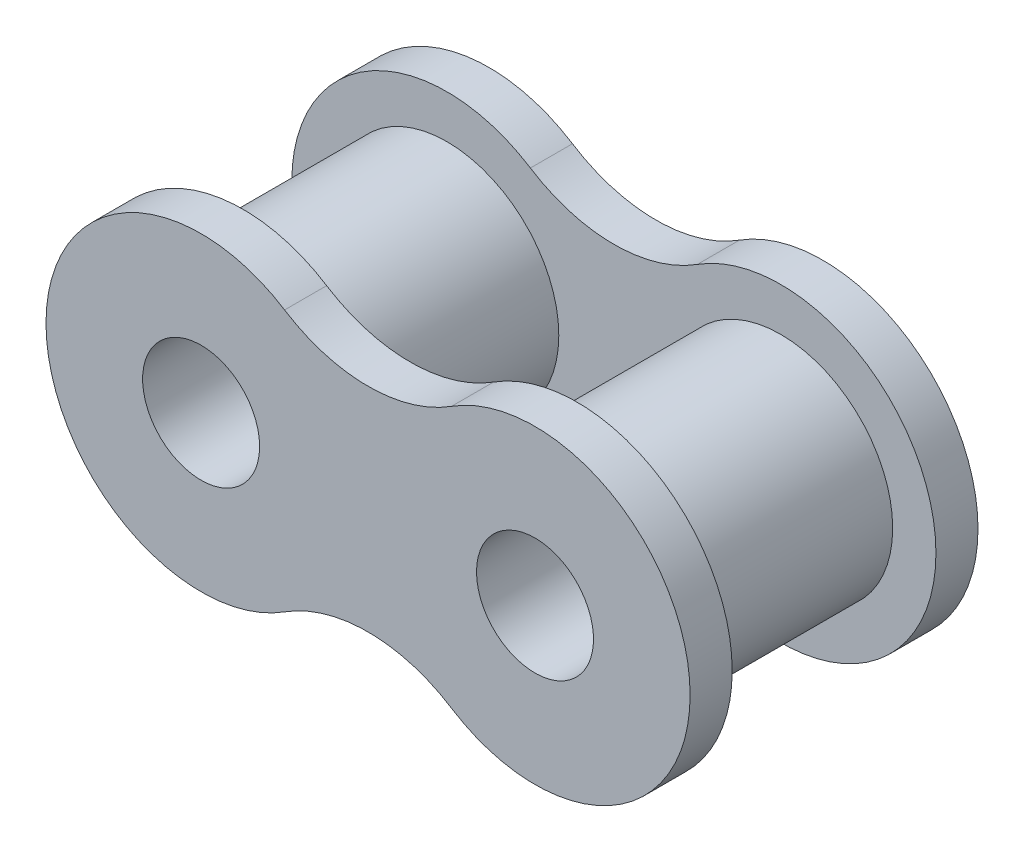
ISO-10303-21;
HEADER;
FILE_DESCRIPTION(('STEP AP214'),'2;1');
FILE_NAME('part.step','',(''),(''),'','','');
FILE_SCHEMA(('AUTOMOTIVE_DESIGN { 1 0 10303 214 1 1 1 1 }'));
ENDSEC;
DATA;
#1=APPLICATION_CONTEXT('core data for automotive mechanical design processes');
#2=APPLICATION_PROTOCOL_DEFINITION('international standard','automotive_design',2000,#1);
#3=PRODUCT_CONTEXT('',#1,'mechanical');
#4=PRODUCT('Part','Part','',(#3));
#5=PRODUCT_RELATED_PRODUCT_CATEGORY('part','',(#4));
#6=PRODUCT_DEFINITION_FORMATION('','',#4);
#7=PRODUCT_DEFINITION_CONTEXT('part definition',#1,'design');
#8=PRODUCT_DEFINITION('design','',#6,#7);
#9=PRODUCT_DEFINITION_SHAPE('','',#8);
#10=(LENGTH_UNIT() NAMED_UNIT(*) SI_UNIT(.MILLI.,.METRE.));
#11=(NAMED_UNIT(*) PLANE_ANGLE_UNIT() SI_UNIT($,.RADIAN.));
#12=(NAMED_UNIT(*) SI_UNIT($,.STERADIAN.) SOLID_ANGLE_UNIT());
#13=UNCERTAINTY_MEASURE_WITH_UNIT(LENGTH_MEASURE(1.E-05),#10,'distance_accuracy_value','');
#14=(GEOMETRIC_REPRESENTATION_CONTEXT(3) GLOBAL_UNCERTAINTY_ASSIGNED_CONTEXT((#13)) GLOBAL_UNIT_ASSIGNED_CONTEXT((#10,
#11,#12)) REPRESENTATION_CONTEXT('',''));
#15=CARTESIAN_POINT('',(0.,0.,0.));
#16=DIRECTION('',(0.,0.,1.));
#17=DIRECTION('',(1.,0.,0.));
#18=AXIS2_PLACEMENT_3D('',#15,#16,#17);
#19=CARTESIAN_POINT('',(-6.35000000000001,0.,-5.475));
#20=DIRECTION('',(0.,0.,1.));
#21=DIRECTION('',(1.,0.,0.));
#22=AXIS2_PLACEMENT_3D('',#19,#20,#21);
#23=CYLINDRICAL_SURFACE('',#22,5.90000000000001);
#24=CARTESIAN_POINT('',(-6.35000000000001,0.,-3.875));
#25=DIRECTION('',(0.,0.,1.));
#26=DIRECTION('',(1.,0.,0.));
#27=AXIS2_PLACEMENT_3D('',#24,#25,#26);
#28=CIRCLE('',#27,5.90000000000001);
#29=CARTESIAN_POINT('',(-3.175,4.97286386300692,-3.875));
#30=VERTEX_POINT('',#29);
#31=CARTESIAN_POINT('',(-3.175,-4.97286386300691,-3.875));
#32=VERTEX_POINT('',#31);
#33=EDGE_CURVE('E136',#30,#32,#28,.T.);
#34=ORIENTED_EDGE('',*,*,#33,.F.);
#35=DIRECTION('',(0.,0.,1.));
#36=VECTOR('',#35,1.);
#37=CARTESIAN_POINT('',(-3.175,4.97286386300692,-5.475));
#38=LINE('',#37,#36);
#39=CARTESIAN_POINT('',(-3.175,4.97286386300692,-5.475));
#40=VERTEX_POINT('',#39);
#41=EDGE_CURVE('E64',#40,#30,#38,.T.);
#42=ORIENTED_EDGE('',*,*,#41,.F.);
#43=CARTESIAN_POINT('',(-6.35000000000001,0.,-5.475));
#44=DIRECTION('',(0.,0.,1.));
#45=DIRECTION('',(1.,0.,0.));
#46=AXIS2_PLACEMENT_3D('',#43,#44,#45);
#47=CIRCLE('',#46,5.90000000000001);
#48=CARTESIAN_POINT('',(-3.175,-4.97286386300691,-5.475));
#49=VERTEX_POINT('',#48);
#50=EDGE_CURVE('E108',#40,#49,#47,.T.);
#51=ORIENTED_EDGE('',*,*,#50,.T.);
#52=DIRECTION('',(0.,0.,1.));
#53=VECTOR('',#52,1.);
#54=CARTESIAN_POINT('',(-3.175,-4.97286386300691,-5.475));
#55=LINE('',#54,#53);
#56=EDGE_CURVE('E79',#49,#32,#55,.T.);
#57=ORIENTED_EDGE('',*,*,#56,.T.);
#58=EDGE_LOOP('',(#34,#42,#51,#57));
#59=FACE_BOUND('',#58,.T.);
#60=ADVANCED_FACE('F56',(#59),#23,.T.);
#61=CARTESIAN_POINT('',(0.,9.94572772601383,-5.475));
#62=DIRECTION('',(0.,0.,1.));
#63=DIRECTION('',(1.,0.,0.));
#64=AXIS2_PLACEMENT_3D('',#61,#62,#63);
#65=CYLINDRICAL_SURFACE('',#64,5.9);
#66=CARTESIAN_POINT('',(0.,9.94572772601383,-3.875));
#67=DIRECTION('',(0.,0.,1.));
#68=DIRECTION('',(1.,0.,0.));
#69=AXIS2_PLACEMENT_3D('',#66,#67,#68);
#70=CIRCLE('',#69,5.9);
#71=CARTESIAN_POINT('',(3.175,4.97286386300692,-3.875));
#72=VERTEX_POINT('',#71);
#73=EDGE_CURVE('E100',#30,#72,#70,.T.);
#74=ORIENTED_EDGE('',*,*,#73,.T.);
#75=DIRECTION('',(0.,0.,1.));
#76=VECTOR('',#75,1.);
#77=CARTESIAN_POINT('',(3.175,4.97286386300692,-5.475));
#78=LINE('',#77,#76);
#79=CARTESIAN_POINT('',(3.175,4.97286386300692,-5.475));
#80=VERTEX_POINT('',#79);
#81=EDGE_CURVE('E103',#80,#72,#78,.T.);
#82=ORIENTED_EDGE('',*,*,#81,.F.);
#83=CARTESIAN_POINT('',(0.,9.94572772601383,-5.475));
#84=DIRECTION('',(0.,0.,1.));
#85=DIRECTION('',(1.,0.,0.));
#86=AXIS2_PLACEMENT_3D('',#83,#84,#85);
#87=CIRCLE('',#86,5.9);
#88=EDGE_CURVE('E87',#40,#80,#87,.T.);
#89=ORIENTED_EDGE('',*,*,#88,.F.);
#90=ORIENTED_EDGE('',*,*,#41,.T.);
#91=EDGE_LOOP('',(#74,#82,#89,#90));
#92=FACE_BOUND('',#91,.T.);
#93=ADVANCED_FACE('F102',(#92),#65,.F.);
#94=CARTESIAN_POINT('',(0.,-9.94572772601383,-5.475));
#95=DIRECTION('',(0.,0.,1.));
#96=DIRECTION('',(1.,0.,0.));
#97=AXIS2_PLACEMENT_3D('',#94,#95,#96);
#98=CYLINDRICAL_SURFACE('',#97,5.9);
#99=CARTESIAN_POINT('',(0.,-9.94572772601383,-3.875));
#100=DIRECTION('',(0.,0.,-1.));
#101=DIRECTION('',(-1.,0.,0.));
#102=AXIS2_PLACEMENT_3D('',#99,#100,#101);
#103=CIRCLE('',#102,5.9);
#104=CARTESIAN_POINT('',(3.175,-4.97286386300691,-3.875));
#105=VERTEX_POINT('',#104);
#106=EDGE_CURVE('E109',#32,#105,#103,.T.);
#107=ORIENTED_EDGE('',*,*,#106,.F.);
#108=ORIENTED_EDGE('',*,*,#56,.F.);
#109=CARTESIAN_POINT('',(0.,-9.94572772601383,-5.475));
#110=DIRECTION('',(0.,0.,-1.));
#111=DIRECTION('',(-1.,0.,0.));
#112=AXIS2_PLACEMENT_3D('',#109,#110,#111);
#113=CIRCLE('',#112,5.9);
#114=CARTESIAN_POINT('',(3.175,-4.97286386300691,-5.475));
#115=VERTEX_POINT('',#114);
#116=EDGE_CURVE('E138',#49,#115,#113,.T.);
#117=ORIENTED_EDGE('',*,*,#116,.T.);
#118=DIRECTION('',(0.,0.,1.));
#119=VECTOR('',#118,1.);
#120=CARTESIAN_POINT('',(3.175,-4.97286386300691,-5.475));
#121=LINE('',#120,#119);
#122=EDGE_CURVE('E118',#115,#105,#121,.T.);
#123=ORIENTED_EDGE('',*,*,#122,.T.);
#124=EDGE_LOOP('',(#107,#108,#117,#123));
#125=FACE_BOUND('',#124,.T.);
#126=ADVANCED_FACE('F147',(#125),#98,.F.);
#127=CARTESIAN_POINT('',(-6.35000000000001,0.,-5.475));
#128=DIRECTION('',(0.,0.,1.));
#129=DIRECTION('',(1.,0.,0.));
#130=AXIS2_PLACEMENT_3D('',#127,#128,#129);
#131=PLANE('',#130);
#132=CARTESIAN_POINT('',(-6.35000000000001,0.,-5.475));
#133=DIRECTION('',(0.,0.,1.));
#134=DIRECTION('',(1.,0.,0.));
#135=AXIS2_PLACEMENT_3D('',#132,#133,#134);
#136=CIRCLE('',#135,2.225);
#137=CARTESIAN_POINT('',(-4.12500000000001,0.,-5.475));
#138=VERTEX_POINT('',#137);
#139=EDGE_CURVE('E133',#138,#138,#136,.T.);
#140=ORIENTED_EDGE('',*,*,#139,.T.);
#141=EDGE_LOOP('',(#140));
#142=FACE_BOUND('',#141,.T.);
#143=ORIENTED_EDGE('',*,*,#50,.F.);
#144=ORIENTED_EDGE('',*,*,#88,.T.);
#145=CARTESIAN_POINT('',(6.35000000000001,0.,-5.475));
#146=DIRECTION('',(0.,0.,-1.));
#147=DIRECTION('',(-1.,0.,0.));
#148=AXIS2_PLACEMENT_3D('',#145,#146,#147);
#149=CIRCLE('',#148,5.90000000000001);
#150=EDGE_CURVE('E116',#80,#115,#149,.T.);
#151=ORIENTED_EDGE('',*,*,#150,.T.);
#152=ORIENTED_EDGE('',*,*,#116,.F.);
#153=EDGE_LOOP('',(#143,#144,#151,#152));
#154=FACE_BOUND('',#153,.T.);
#155=CARTESIAN_POINT('',(6.35000000000001,0.,-5.475));
#156=DIRECTION('',(0.,0.,-1.));
#157=DIRECTION('',(-1.,0.,0.));
#158=AXIS2_PLACEMENT_3D('',#155,#156,#157);
#159=CIRCLE('',#158,2.225);
#160=CARTESIAN_POINT('',(4.12500000000001,0.,-5.475));
#161=VERTEX_POINT('',#160);
#162=EDGE_CURVE('E123',#161,#161,#159,.T.);
#163=ORIENTED_EDGE('',*,*,#162,.F.);
#164=EDGE_LOOP('',(#163));
#165=FACE_BOUND('',#164,.T.);
#166=ADVANCED_FACE('F152',(#142,#154,#165),#131,.F.);
#167=CARTESIAN_POINT('',(-6.35000000000001,0.,-3.875));
#168=DIRECTION('',(0.,0.,1.));
#169=DIRECTION('',(1.,0.,0.));
#170=AXIS2_PLACEMENT_3D('',#167,#168,#169);
#171=PLANE('',#170);
#172=CARTESIAN_POINT('',(-6.35000000000001,0.,-3.875));
#173=DIRECTION('',(0.,0.,1.));
#174=DIRECTION('',(1.,0.,0.));
#175=AXIS2_PLACEMENT_3D('',#172,#173,#174);
#176=CIRCLE('',#175,4.255);
#177=CARTESIAN_POINT('',(-2.09500000000001,0.,-3.875));
#178=VERTEX_POINT('',#177);
#179=EDGE_CURVE('E12',#178,#178,#176,.T.);
#180=ORIENTED_EDGE('',*,*,#179,.F.);
#181=EDGE_LOOP('',(#180));
#182=FACE_BOUND('',#181,.T.);
#183=ORIENTED_EDGE('',*,*,#33,.T.);
#184=ORIENTED_EDGE('',*,*,#106,.T.);
#185=CARTESIAN_POINT('',(6.35000000000001,0.,-3.875));
#186=DIRECTION('',(0.,0.,-1.));
#187=DIRECTION('',(-1.,0.,0.));
#188=AXIS2_PLACEMENT_3D('',#185,#186,#187);
#189=CIRCLE('',#188,5.90000000000001);
#190=EDGE_CURVE('E115',#72,#105,#189,.T.);
#191=ORIENTED_EDGE('',*,*,#190,.F.);
#192=ORIENTED_EDGE('',*,*,#73,.F.);
#193=EDGE_LOOP('',(#183,#184,#191,#192));
#194=FACE_BOUND('',#193,.T.);
#195=CARTESIAN_POINT('',(6.35000000000001,0.,-3.875));
#196=DIRECTION('',(0.,0.,-1.));
#197=DIRECTION('',(-1.,0.,0.));
#198=AXIS2_PLACEMENT_3D('',#195,#196,#197);
#199=CIRCLE('',#198,4.255);
#200=CARTESIAN_POINT('',(2.09500000000001,0.,-3.875));
#201=VERTEX_POINT('',#200);
#202=EDGE_CURVE('E117',#201,#201,#199,.T.);
#203=ORIENTED_EDGE('',*,*,#202,.T.);
#204=EDGE_LOOP('',(#203));
#205=FACE_BOUND('',#204,.T.);
#206=ADVANCED_FACE('F120',(#182,#194,#205),#171,.T.);
#207=CARTESIAN_POINT('',(-6.35000000000001,0.,-5.475));
#208=DIRECTION('',(0.,0.,1.));
#209=DIRECTION('',(1.,0.,0.));
#210=AXIS2_PLACEMENT_3D('',#207,#208,#209);
#211=CYLINDRICAL_SURFACE('',#210,2.225);
#212=ORIENTED_EDGE('',*,*,#139,.F.);
#213=EDGE_LOOP('',(#212));
#214=FACE_BOUND('',#213,.T.);
#215=CARTESIAN_POINT('',(-6.35000000000001,0.,5.475));
#216=DIRECTION('',(0.,0.,1.));
#217=DIRECTION('',(1.,0.,0.));
#218=AXIS2_PLACEMENT_3D('',#215,#216,#217);
#219=CIRCLE('',#218,2.225);
#220=CARTESIAN_POINT('',(-4.12500000000001,0.,5.475));
#221=VERTEX_POINT('',#220);
#222=EDGE_CURVE('E263',#221,#221,#219,.T.);
#223=ORIENTED_EDGE('',*,*,#222,.T.);
#224=EDGE_LOOP('',(#223));
#225=FACE_BOUND('',#224,.T.);
#226=ADVANCED_FACE('F157',(#214,#225),#211,.F.);
#227=CARTESIAN_POINT('',(-6.35000000000001,0.,-15.909957415795));
#228=DIRECTION('',(0.,0.,1.));
#229=DIRECTION('',(1.,0.,0.));
#230=AXIS2_PLACEMENT_3D('',#227,#228,#229);
#231=CYLINDRICAL_SURFACE('',#230,4.255);
#232=ORIENTED_EDGE('',*,*,#179,.T.);
#233=EDGE_LOOP('',(#232));
#234=FACE_BOUND('',#233,.T.);
#235=CARTESIAN_POINT('',(-6.35000000000001,0.,3.875));
#236=DIRECTION('',(0.,0.,1.));
#237=DIRECTION('',(1.,0.,0.));
#238=AXIS2_PLACEMENT_3D('',#235,#236,#237);
#239=CIRCLE('',#238,4.255);
#240=CARTESIAN_POINT('',(-2.09500000000001,0.,3.875));
#241=VERTEX_POINT('',#240);
#242=EDGE_CURVE('E127',#241,#241,#239,.T.);
#243=ORIENTED_EDGE('',*,*,#242,.F.);
#244=EDGE_LOOP('',(#243));
#245=FACE_BOUND('',#244,.T.);
#246=ADVANCED_FACE('F164',(#234,#245),#231,.T.);
#247=CARTESIAN_POINT('',(6.35000000000001,0.,-5.475));
#248=DIRECTION('',(0.,0.,1.));
#249=DIRECTION('',(-1.,0.,0.));
#250=AXIS2_PLACEMENT_3D('',#247,#248,#249);
#251=CYLINDRICAL_SURFACE('',#250,5.90000000000001);
#252=ORIENTED_EDGE('',*,*,#190,.T.);
#253=ORIENTED_EDGE('',*,*,#122,.F.);
#254=ORIENTED_EDGE('',*,*,#150,.F.);
#255=ORIENTED_EDGE('',*,*,#81,.T.);
#256=EDGE_LOOP('',(#252,#253,#254,#255));
#257=FACE_BOUND('',#256,.T.);
#258=ADVANCED_FACE('F113',(#257),#251,.T.);
#259=CARTESIAN_POINT('',(6.35000000000001,0.,-5.475));
#260=DIRECTION('',(0.,0.,1.));
#261=DIRECTION('',(-1.,0.,0.));
#262=AXIS2_PLACEMENT_3D('',#259,#260,#261);
#263=CYLINDRICAL_SURFACE('',#262,2.225);
#264=ORIENTED_EDGE('',*,*,#162,.T.);
#265=EDGE_LOOP('',(#264));
#266=FACE_BOUND('',#265,.T.);
#267=CARTESIAN_POINT('',(6.35000000000001,0.,5.475));
#268=DIRECTION('',(0.,0.,-1.));
#269=DIRECTION('',(-1.,0.,0.));
#270=AXIS2_PLACEMENT_3D('',#267,#268,#269);
#271=CIRCLE('',#270,2.225);
#272=CARTESIAN_POINT('',(4.12500000000001,0.,5.475));
#273=VERTEX_POINT('',#272);
#274=EDGE_CURVE('E225',#273,#273,#271,.T.);
#275=ORIENTED_EDGE('',*,*,#274,.F.);
#276=EDGE_LOOP('',(#275));
#277=FACE_BOUND('',#276,.T.);
#278=ADVANCED_FACE('F171',(#266,#277),#263,.F.);
#279=CARTESIAN_POINT('',(6.35000000000001,0.,-15.909957415795));
#280=DIRECTION('',(0.,0.,1.));
#281=DIRECTION('',(-1.,0.,0.));
#282=AXIS2_PLACEMENT_3D('',#279,#280,#281);
#283=CYLINDRICAL_SURFACE('',#282,4.255);
#284=ORIENTED_EDGE('',*,*,#202,.F.);
#285=EDGE_LOOP('',(#284));
#286=FACE_BOUND('',#285,.T.);
#287=CARTESIAN_POINT('',(6.35000000000001,0.,3.875));
#288=DIRECTION('',(0.,0.,-1.));
#289=DIRECTION('',(-1.,0.,0.));
#290=AXIS2_PLACEMENT_3D('',#287,#288,#289);
#291=CIRCLE('',#290,4.255);
#292=CARTESIAN_POINT('',(2.09500000000001,0.,3.875));
#293=VERTEX_POINT('',#292);
#294=EDGE_CURVE('E234',#293,#293,#291,.T.);
#295=ORIENTED_EDGE('',*,*,#294,.T.);
#296=EDGE_LOOP('',(#295));
#297=FACE_BOUND('',#296,.T.);
#298=ADVANCED_FACE('F174',(#286,#297),#283,.T.);
#299=CARTESIAN_POINT('',(-6.35000000000001,0.,5.475));
#300=DIRECTION('',(0.,0.,-1.));
#301=DIRECTION('',(1.,0.,0.));
#302=AXIS2_PLACEMENT_3D('',#299,#300,#301);
#303=CYLINDRICAL_SURFACE('',#302,5.90000000000001);
#304=CARTESIAN_POINT('',(-6.35000000000001,0.,3.875));
#305=DIRECTION('',(0.,0.,1.));
#306=DIRECTION('',(1.,0.,0.));
#307=AXIS2_PLACEMENT_3D('',#304,#305,#306);
#308=CIRCLE('',#307,5.90000000000001);
#309=CARTESIAN_POINT('',(-3.175,4.97286386300692,3.875));
#310=VERTEX_POINT('',#309);
#311=CARTESIAN_POINT('',(-3.175,-4.97286386300691,3.875));
#312=VERTEX_POINT('',#311);
#313=EDGE_CURVE('E239',#310,#312,#308,.T.);
#314=ORIENTED_EDGE('',*,*,#313,.T.);
#315=DIRECTION('',(0.,0.,-1.));
#316=VECTOR('',#315,1.);
#317=CARTESIAN_POINT('',(-3.175,-4.97286386300691,5.475));
#318=LINE('',#317,#316);
#319=CARTESIAN_POINT('',(-3.175,-4.97286386300691,5.475));
#320=VERTEX_POINT('',#319);
#321=EDGE_CURVE('E251',#320,#312,#318,.T.);
#322=ORIENTED_EDGE('',*,*,#321,.F.);
#323=CARTESIAN_POINT('',(-6.35000000000001,0.,5.475));
#324=DIRECTION('',(0.,0.,1.));
#325=DIRECTION('',(1.,0.,0.));
#326=AXIS2_PLACEMENT_3D('',#323,#324,#325);
#327=CIRCLE('',#326,5.90000000000001);
#328=CARTESIAN_POINT('',(-3.175,4.97286386300692,5.475));
#329=VERTEX_POINT('',#328);
#330=EDGE_CURVE('E240',#329,#320,#327,.T.);
#331=ORIENTED_EDGE('',*,*,#330,.F.);
#332=DIRECTION('',(0.,0.,-1.));
#333=VECTOR('',#332,1.);
#334=CARTESIAN_POINT('',(-3.175,4.97286386300692,5.475));
#335=LINE('',#334,#333);
#336=EDGE_CURVE('E249',#329,#310,#335,.T.);
#337=ORIENTED_EDGE('',*,*,#336,.T.);
#338=EDGE_LOOP('',(#314,#322,#331,#337));
#339=FACE_BOUND('',#338,.T.);
#340=ADVANCED_FACE('F178',(#339),#303,.T.);
#341=CARTESIAN_POINT('',(0.,9.94572772601383,5.475));
#342=DIRECTION('',(0.,0.,-1.));
#343=DIRECTION('',(1.,0.,0.));
#344=AXIS2_PLACEMENT_3D('',#341,#342,#343);
#345=CYLINDRICAL_SURFACE('',#344,5.9);
#346=CARTESIAN_POINT('',(0.,9.94572772601383,3.875));
#347=DIRECTION('',(0.,0.,1.));
#348=DIRECTION('',(1.,0.,0.));
#349=AXIS2_PLACEMENT_3D('',#346,#347,#348);
#350=CIRCLE('',#349,5.9);
#351=CARTESIAN_POINT('',(3.175,4.97286386300692,3.875));
#352=VERTEX_POINT('',#351);
#353=EDGE_CURVE('E230',#310,#352,#350,.T.);
#354=ORIENTED_EDGE('',*,*,#353,.F.);
#355=ORIENTED_EDGE('',*,*,#336,.F.);
#356=CARTESIAN_POINT('',(0.,9.94572772601383,5.475));
#357=DIRECTION('',(0.,0.,1.));
#358=DIRECTION('',(1.,0.,0.));
#359=AXIS2_PLACEMENT_3D('',#356,#357,#358);
#360=CIRCLE('',#359,5.9);
#361=CARTESIAN_POINT('',(3.175,4.97286386300692,5.475));
#362=VERTEX_POINT('',#361);
#363=EDGE_CURVE('E233',#329,#362,#360,.T.);
#364=ORIENTED_EDGE('',*,*,#363,.T.);
#365=DIRECTION('',(0.,0.,-1.));
#366=VECTOR('',#365,1.);
#367=CARTESIAN_POINT('',(3.175,4.97286386300692,5.475));
#368=LINE('',#367,#366);
#369=EDGE_CURVE('E213',#362,#352,#368,.T.);
#370=ORIENTED_EDGE('',*,*,#369,.T.);
#371=EDGE_LOOP('',(#354,#355,#364,#370));
#372=FACE_BOUND('',#371,.T.);
#373=ADVANCED_FACE('F182',(#372),#345,.F.);
#374=CARTESIAN_POINT('',(0.,-9.94572772601383,5.475));
#375=DIRECTION('',(0.,0.,-1.));
#376=DIRECTION('',(1.,0.,0.));
#377=AXIS2_PLACEMENT_3D('',#374,#375,#376);
#378=CYLINDRICAL_SURFACE('',#377,5.9);
#379=CARTESIAN_POINT('',(0.,-9.94572772601383,3.875));
#380=DIRECTION('',(0.,0.,-1.));
#381=DIRECTION('',(-1.,0.,0.));
#382=AXIS2_PLACEMENT_3D('',#379,#380,#381);
#383=CIRCLE('',#382,5.9);
#384=CARTESIAN_POINT('',(3.175,-4.97286386300691,3.875));
#385=VERTEX_POINT('',#384);
#386=EDGE_CURVE('E241',#312,#385,#383,.T.);
#387=ORIENTED_EDGE('',*,*,#386,.T.);
#388=DIRECTION('',(0.,0.,-1.));
#389=VECTOR('',#388,1.);
#390=CARTESIAN_POINT('',(3.175,-4.97286386300691,5.475));
#391=LINE('',#390,#389);
#392=CARTESIAN_POINT('',(3.175,-4.97286386300691,5.475));
#393=VERTEX_POINT('',#392);
#394=EDGE_CURVE('E217',#393,#385,#391,.T.);
#395=ORIENTED_EDGE('',*,*,#394,.F.);
#396=CARTESIAN_POINT('',(0.,-9.94572772601383,5.475));
#397=DIRECTION('',(0.,0.,-1.));
#398=DIRECTION('',(-1.,0.,0.));
#399=AXIS2_PLACEMENT_3D('',#396,#397,#398);
#400=CIRCLE('',#399,5.9);
#401=EDGE_CURVE('E244',#320,#393,#400,.T.);
#402=ORIENTED_EDGE('',*,*,#401,.F.);
#403=ORIENTED_EDGE('',*,*,#321,.T.);
#404=EDGE_LOOP('',(#387,#395,#402,#403));
#405=FACE_BOUND('',#404,.T.);
#406=ADVANCED_FACE('F184',(#405),#378,.F.);
#407=CARTESIAN_POINT('',(-6.35000000000001,0.,5.475));
#408=DIRECTION('',(0.,0.,-1.));
#409=DIRECTION('',(1.,0.,0.));
#410=AXIS2_PLACEMENT_3D('',#407,#408,#409);
#411=PLANE('',#410);
#412=ORIENTED_EDGE('',*,*,#222,.F.);
#413=EDGE_LOOP('',(#412));
#414=FACE_BOUND('',#413,.T.);
#415=ORIENTED_EDGE('',*,*,#330,.T.);
#416=ORIENTED_EDGE('',*,*,#401,.T.);
#417=CARTESIAN_POINT('',(6.35000000000001,0.,5.475));
#418=DIRECTION('',(0.,0.,-1.));
#419=DIRECTION('',(-1.,0.,0.));
#420=AXIS2_PLACEMENT_3D('',#417,#418,#419);
#421=CIRCLE('',#420,5.90000000000001);
#422=EDGE_CURVE('E224',#362,#393,#421,.T.);
#423=ORIENTED_EDGE('',*,*,#422,.F.);
#424=ORIENTED_EDGE('',*,*,#363,.F.);
#425=EDGE_LOOP('',(#415,#416,#423,#424));
#426=FACE_BOUND('',#425,.T.);
#427=ORIENTED_EDGE('',*,*,#274,.T.);
#428=EDGE_LOOP('',(#427));
#429=FACE_BOUND('',#428,.T.);
#430=ADVANCED_FACE('F187',(#414,#426,#429),#411,.F.);
#431=CARTESIAN_POINT('',(-6.35000000000001,0.,3.875));
#432=DIRECTION('',(0.,0.,-1.));
#433=DIRECTION('',(1.,0.,0.));
#434=AXIS2_PLACEMENT_3D('',#431,#432,#433);
#435=PLANE('',#434);
#436=ORIENTED_EDGE('',*,*,#242,.T.);
#437=EDGE_LOOP('',(#436));
#438=FACE_BOUND('',#437,.T.);
#439=ORIENTED_EDGE('',*,*,#313,.F.);
#440=ORIENTED_EDGE('',*,*,#353,.T.);
#441=CARTESIAN_POINT('',(6.35000000000001,0.,3.875));
#442=DIRECTION('',(0.,0.,-1.));
#443=DIRECTION('',(-1.,0.,0.));
#444=AXIS2_PLACEMENT_3D('',#441,#442,#443);
#445=CIRCLE('',#444,5.90000000000001);
#446=EDGE_CURVE('E209',#352,#385,#445,.T.);
#447=ORIENTED_EDGE('',*,*,#446,.T.);
#448=ORIENTED_EDGE('',*,*,#386,.F.);
#449=EDGE_LOOP('',(#439,#440,#447,#448));
#450=FACE_BOUND('',#449,.T.);
#451=ORIENTED_EDGE('',*,*,#294,.F.);
#452=EDGE_LOOP('',(#451));
#453=FACE_BOUND('',#452,.T.);
#454=ADVANCED_FACE('F192',(#438,#450,#453),#435,.T.);
#455=CARTESIAN_POINT('',(6.35000000000001,0.,5.475));
#456=DIRECTION('',(0.,0.,-1.));
#457=DIRECTION('',(-1.,0.,0.));
#458=AXIS2_PLACEMENT_3D('',#455,#456,#457);
#459=CYLINDRICAL_SURFACE('',#458,5.90000000000001);
#460=ORIENTED_EDGE('',*,*,#446,.F.);
#461=ORIENTED_EDGE('',*,*,#369,.F.);
#462=ORIENTED_EDGE('',*,*,#422,.T.);
#463=ORIENTED_EDGE('',*,*,#394,.T.);
#464=EDGE_LOOP('',(#460,#461,#462,#463));
#465=FACE_BOUND('',#464,.T.);
#466=ADVANCED_FACE('F195',(#465),#459,.T.);
#467=CLOSED_SHELL('',(#60,#93,#126,#166,#206,#226,#246,#258,#278,#298,#340,#373,#406,#430,#454,#466));
#468=MANIFOLD_SOLID_BREP('B2',#467);
#469=ADVANCED_BREP_SHAPE_REPRESENTATION('',(#18,#468),#14);
#470=SHAPE_DEFINITION_REPRESENTATION(#9,#469);
ENDSEC;
END-ISO-10303-21;
